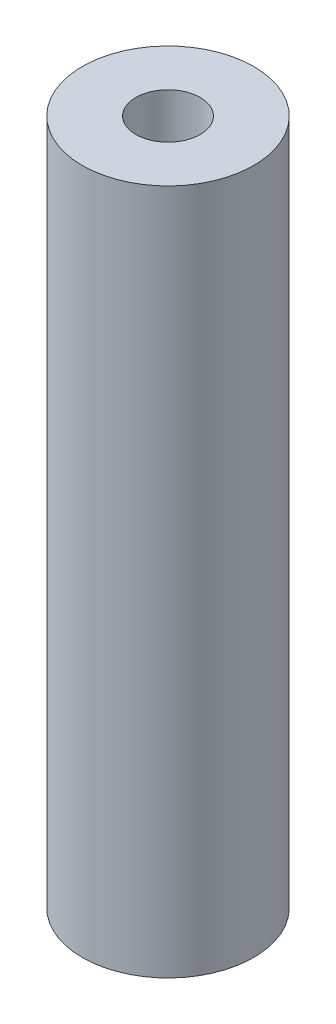
ISO-10303-21;
HEADER;
FILE_DESCRIPTION(('STEP AP214'),'2;1');
FILE_NAME('part.step','',(''),(''),'','','');
FILE_SCHEMA(('AUTOMOTIVE_DESIGN { 1 0 10303 214 1 1 1 1 }'));
ENDSEC;
DATA;
#1=APPLICATION_CONTEXT('core data for automotive mechanical design processes');
#2=APPLICATION_PROTOCOL_DEFINITION('international standard','automotive_design',2000,#1);
#3=PRODUCT_CONTEXT('',#1,'mechanical');
#4=PRODUCT('Part','Part','',(#3));
#5=PRODUCT_RELATED_PRODUCT_CATEGORY('part','',(#4));
#6=PRODUCT_DEFINITION_FORMATION('','',#4);
#7=PRODUCT_DEFINITION_CONTEXT('part definition',#1,'design');
#8=PRODUCT_DEFINITION('design','',#6,#7);
#9=PRODUCT_DEFINITION_SHAPE('','',#8);
#10=(LENGTH_UNIT() NAMED_UNIT(*) SI_UNIT(.MILLI.,.METRE.));
#11=(NAMED_UNIT(*) PLANE_ANGLE_UNIT() SI_UNIT($,.RADIAN.));
#12=(NAMED_UNIT(*) SI_UNIT($,.STERADIAN.) SOLID_ANGLE_UNIT());
#13=UNCERTAINTY_MEASURE_WITH_UNIT(LENGTH_MEASURE(1.E-05),#10,'distance_accuracy_value','');
#14=(GEOMETRIC_REPRESENTATION_CONTEXT(3) GLOBAL_UNCERTAINTY_ASSIGNED_CONTEXT((#13)) GLOBAL_UNIT_ASSIGNED_CONTEXT((#10,
#11,#12)) REPRESENTATION_CONTEXT('',''));
#15=CARTESIAN_POINT('',(0.,0.,0.));
#16=DIRECTION('',(0.,0.,1.));
#17=DIRECTION('',(1.,0.,0.));
#18=AXIS2_PLACEMENT_3D('',#15,#16,#17);
#19=CARTESIAN_POINT('',(0.,101.6,0.));
#20=DIRECTION('',(0.,1.,0.));
#21=DIRECTION('',(0.,0.,-1.));
#22=AXIS2_PLACEMENT_3D('',#19,#20,#21);
#23=PLANE('',#22);
#24=CARTESIAN_POINT('',(0.,101.6,0.));
#25=DIRECTION('',(0.,-1.,0.));
#26=DIRECTION('',(0.,0.,-1.));
#27=AXIS2_PLACEMENT_3D('',#24,#25,#26);
#28=CIRCLE('',#27,12.7);
#29=CARTESIAN_POINT('',(0.,101.6,-12.7));
#30=VERTEX_POINT('',#29);
#31=EDGE_CURVE('E10',#30,#30,#28,.T.);
#32=ORIENTED_EDGE('',*,*,#31,.F.);
#33=EDGE_LOOP('',(#32));
#34=FACE_BOUND('',#33,.T.);
#35=CARTESIAN_POINT('',(0.,101.6,0.));
#36=DIRECTION('',(0.,-1.,0.));
#37=DIRECTION('',(0.,0.,-1.));
#38=AXIS2_PLACEMENT_3D('',#35,#36,#37);
#39=CIRCLE('',#38,4.7625);
#40=CARTESIAN_POINT('',(0.,101.6,-4.7625));
#41=VERTEX_POINT('',#40);
#42=EDGE_CURVE('E46',#41,#41,#39,.T.);
#43=ORIENTED_EDGE('',*,*,#42,.T.);
#44=EDGE_LOOP('',(#43));
#45=FACE_BOUND('',#44,.T.);
#46=ADVANCED_FACE('F35',(#34,#45),#23,.T.);
#47=CARTESIAN_POINT('',(0.,0.,0.));
#48=DIRECTION('',(0.,1.,0.));
#49=DIRECTION('',(0.,0.,-1.));
#50=AXIS2_PLACEMENT_3D('',#47,#48,#49);
#51=PLANE('',#50);
#52=CARTESIAN_POINT('',(0.,0.,0.));
#53=DIRECTION('',(0.,-1.,0.));
#54=DIRECTION('',(0.,0.,-1.));
#55=AXIS2_PLACEMENT_3D('',#52,#53,#54);
#56=CIRCLE('',#55,12.7);
#57=CARTESIAN_POINT('',(0.,0.,-12.7));
#58=VERTEX_POINT('',#57);
#59=EDGE_CURVE('E39',#58,#58,#56,.T.);
#60=ORIENTED_EDGE('',*,*,#59,.T.);
#61=EDGE_LOOP('',(#60));
#62=FACE_BOUND('',#61,.T.);
#63=CARTESIAN_POINT('',(0.,0.,0.));
#64=DIRECTION('',(0.,-1.,0.));
#65=DIRECTION('',(0.,0.,-1.));
#66=AXIS2_PLACEMENT_3D('',#63,#64,#65);
#67=CIRCLE('',#66,4.7625);
#68=CARTESIAN_POINT('',(0.,0.,-4.7625));
#69=VERTEX_POINT('',#68);
#70=EDGE_CURVE('E48',#69,#69,#67,.T.);
#71=ORIENTED_EDGE('',*,*,#70,.F.);
#72=EDGE_LOOP('',(#71));
#73=FACE_BOUND('',#72,.T.);
#74=ADVANCED_FACE('F61',(#62,#73),#51,.F.);
#75=CARTESIAN_POINT('',(0.,101.6,0.));
#76=DIRECTION('',(0.,-1.,0.));
#77=DIRECTION('',(0.,0.,1.));
#78=AXIS2_PLACEMENT_3D('',#75,#76,#77);
#79=CYLINDRICAL_SURFACE('',#78,12.7);
#80=ORIENTED_EDGE('',*,*,#31,.T.);
#81=EDGE_LOOP('',(#80));
#82=FACE_BOUND('',#81,.T.);
#83=ORIENTED_EDGE('',*,*,#59,.F.);
#84=EDGE_LOOP('',(#83));
#85=FACE_BOUND('',#84,.T.);
#86=ADVANCED_FACE('F37',(#82,#85),#79,.T.);
#87=CARTESIAN_POINT('',(0.,101.6,0.));
#88=DIRECTION('',(0.,-1.,0.));
#89=DIRECTION('',(0.,0.,1.));
#90=AXIS2_PLACEMENT_3D('',#87,#88,#89);
#91=CYLINDRICAL_SURFACE('',#90,4.7625);
#92=ORIENTED_EDGE('',*,*,#42,.F.);
#93=EDGE_LOOP('',(#92));
#94=FACE_BOUND('',#93,.T.);
#95=ORIENTED_EDGE('',*,*,#70,.T.);
#96=EDGE_LOOP('',(#95));
#97=FACE_BOUND('',#96,.T.);
#98=ADVANCED_FACE('F55',(#94,#97),#91,.F.);
#99=CLOSED_SHELL('',(#46,#74,#86,#98));
#100=MANIFOLD_SOLID_BREP('B2',#99);
#101=ADVANCED_BREP_SHAPE_REPRESENTATION('',(#18,#100),#14);
#102=SHAPE_DEFINITION_REPRESENTATION(#9,#101);
ENDSEC;
END-ISO-10303-21;
